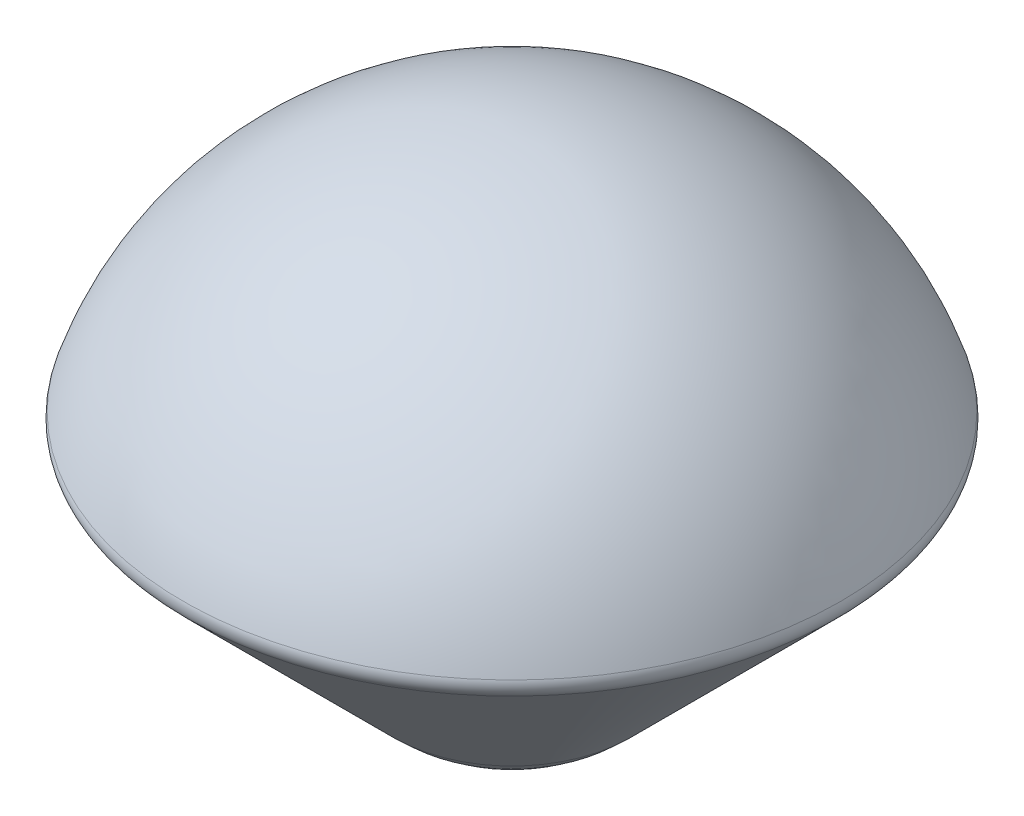
ISO-10303-21;
HEADER;
FILE_DESCRIPTION(('STEP AP214'),'2;1');
FILE_NAME('part.step','',(''),(''),'','','');
FILE_SCHEMA(('AUTOMOTIVE_DESIGN { 1 0 10303 214 1 1 1 1 }'));
ENDSEC;
DATA;
#1=APPLICATION_CONTEXT('core data for automotive mechanical design processes');
#2=APPLICATION_PROTOCOL_DEFINITION('international standard','automotive_design',2000,#1);
#3=PRODUCT_CONTEXT('',#1,'mechanical');
#4=PRODUCT('Part','Part','',(#3));
#5=PRODUCT_RELATED_PRODUCT_CATEGORY('part','',(#4));
#6=PRODUCT_DEFINITION_FORMATION('','',#4);
#7=PRODUCT_DEFINITION_CONTEXT('part definition',#1,'design');
#8=PRODUCT_DEFINITION('design','',#6,#7);
#9=PRODUCT_DEFINITION_SHAPE('','',#8);
#10=(LENGTH_UNIT() NAMED_UNIT(*) SI_UNIT(.MILLI.,.METRE.));
#11=(NAMED_UNIT(*) PLANE_ANGLE_UNIT() SI_UNIT($,.RADIAN.));
#12=(NAMED_UNIT(*) SI_UNIT($,.STERADIAN.) SOLID_ANGLE_UNIT());
#13=UNCERTAINTY_MEASURE_WITH_UNIT(LENGTH_MEASURE(1.E-05),#10,'distance_accuracy_value','');
#14=(GEOMETRIC_REPRESENTATION_CONTEXT(3) GLOBAL_UNCERTAINTY_ASSIGNED_CONTEXT((#13)) GLOBAL_UNIT_ASSIGNED_CONTEXT((#10,
#11,#12)) REPRESENTATION_CONTEXT('',''));
#15=CARTESIAN_POINT('',(0.,0.,0.));
#16=DIRECTION('',(0.,0.,1.));
#17=DIRECTION('',(1.,0.,0.));
#18=AXIS2_PLACEMENT_3D('',#15,#16,#17);
#19=CARTESIAN_POINT('',(0.,-12.5538759689923,0.));
#20=DIRECTION('',(0.,1.,0.));
#21=DIRECTION('',(1.,0.,0.));
#22=AXIS2_PLACEMENT_3D('',#19,#20,#21);
#23=SPHERICAL_SURFACE('',#22,52.1);
#24=CARTESIAN_POINT('',(0.,3.56643102945366,0.));
#25=DIRECTION('',(0.,-1.,0.));
#26=DIRECTION('',(0.,0.,-1.));
#27=AXIS2_PLACEMENT_3D('',#24,#25,#26);
#28=CIRCLE('',#27,49.543371930823);
#29=CARTESIAN_POINT('',(0.,3.56643102945366,-49.543371930823));
#30=VERTEX_POINT('',#29);
#31=EDGE_CURVE('E38',#30,#30,#28,.F.);
#32=ORIENTED_EDGE('',*,*,#31,.T.);
#33=EDGE_LOOP('',(#32));
#34=FACE_BOUND('',#33,.T.);
#35=ADVANCED_FACE('F31',(#34),#23,.T.);
#36=CARTESIAN_POINT('',(0.,-30.1341085271316,0.));
#37=DIRECTION('',(0.,1.,0.));
#38=DIRECTION('',(0.,0.,1.));
#39=AXIS2_PLACEMENT_3D('',#36,#37,#38);
#40=CONICAL_SURFACE('',#39,17.7745723774649,0.785398163397454);
#41=CARTESIAN_POINT('',(0.,1.02513686926819,0.));
#42=DIRECTION('',(0.,-1.,0.));
#43=DIRECTION('',(0.,0.,-1.));
#44=AXIS2_PLACEMENT_3D('',#41,#42,#43);
#45=CIRCLE('',#44,48.933817773865);
#46=CARTESIAN_POINT('',(0.,1.02513686926819,-48.933817773865));
#47=VERTEX_POINT('',#46);
#48=EDGE_CURVE('E10',#47,#47,#45,.T.);
#49=ORIENTED_EDGE('',*,*,#48,.T.);
#50=EDGE_LOOP('',(#49));
#51=FACE_BOUND('',#50,.T.);
#52=CARTESIAN_POINT('',(0.,-30.1341085271316,0.));
#53=DIRECTION('',(0.,1.,0.));
#54=DIRECTION('',(0.,0.,1.));
#55=AXIS2_PLACEMENT_3D('',#52,#53,#54);
#56=CIRCLE('',#55,17.7745723774649);
#57=CARTESIAN_POINT('',(0.,-30.1341085271316,17.7745723774649));
#58=VERTEX_POINT('',#57);
#59=EDGE_CURVE('E42',#58,#58,#56,.T.);
#60=ORIENTED_EDGE('',*,*,#59,.T.);
#61=EDGE_LOOP('',(#60));
#62=FACE_BOUND('',#61,.T.);
#63=ADVANCED_FACE('F49',(#51,#62),#40,.T.);
#64=CARTESIAN_POINT('',(0.,-12.5538759689923,0.));
#65=DIRECTION('',(0.,1.,0.));
#66=DIRECTION('',(1.,0.,0.));
#67=AXIS2_PLACEMENT_3D('',#64,#65,#66);
#68=SPHERICAL_SURFACE('',#67,25.);
#69=ORIENTED_EDGE('',*,*,#59,.F.);
#70=EDGE_LOOP('',(#69));
#71=FACE_BOUND('',#70,.T.);
#72=ADVANCED_FACE('F51',(#71),#68,.T.);
#73=CARTESIAN_POINT('',(0.,2.79290382223457,0.));
#74=DIRECTION('',(0.,-1.,0.));
#75=DIRECTION('',(0.,0.,-1.));
#76=AXIS2_PLACEMENT_3D('',#73,#74,#75);
#77=TOROIDAL_SURFACE('',#76,47.1660508208986,2.5);
#78=ORIENTED_EDGE('',*,*,#48,.F.);
#79=EDGE_LOOP('',(#78));
#80=FACE_BOUND('',#79,.T.);
#81=ORIENTED_EDGE('',*,*,#31,.F.);
#82=EDGE_LOOP('',(#81));
#83=FACE_BOUND('',#82,.T.);
#84=ADVANCED_FACE('F33',(#80,#83),#77,.T.);
#85=CLOSED_SHELL('',(#35,#63,#72,#84));
#86=MANIFOLD_SOLID_BREP('B2',#85);
#87=ADVANCED_BREP_SHAPE_REPRESENTATION('',(#18,#86),#14);
#88=SHAPE_DEFINITION_REPRESENTATION(#9,#87);
ENDSEC;
END-ISO-10303-21;
